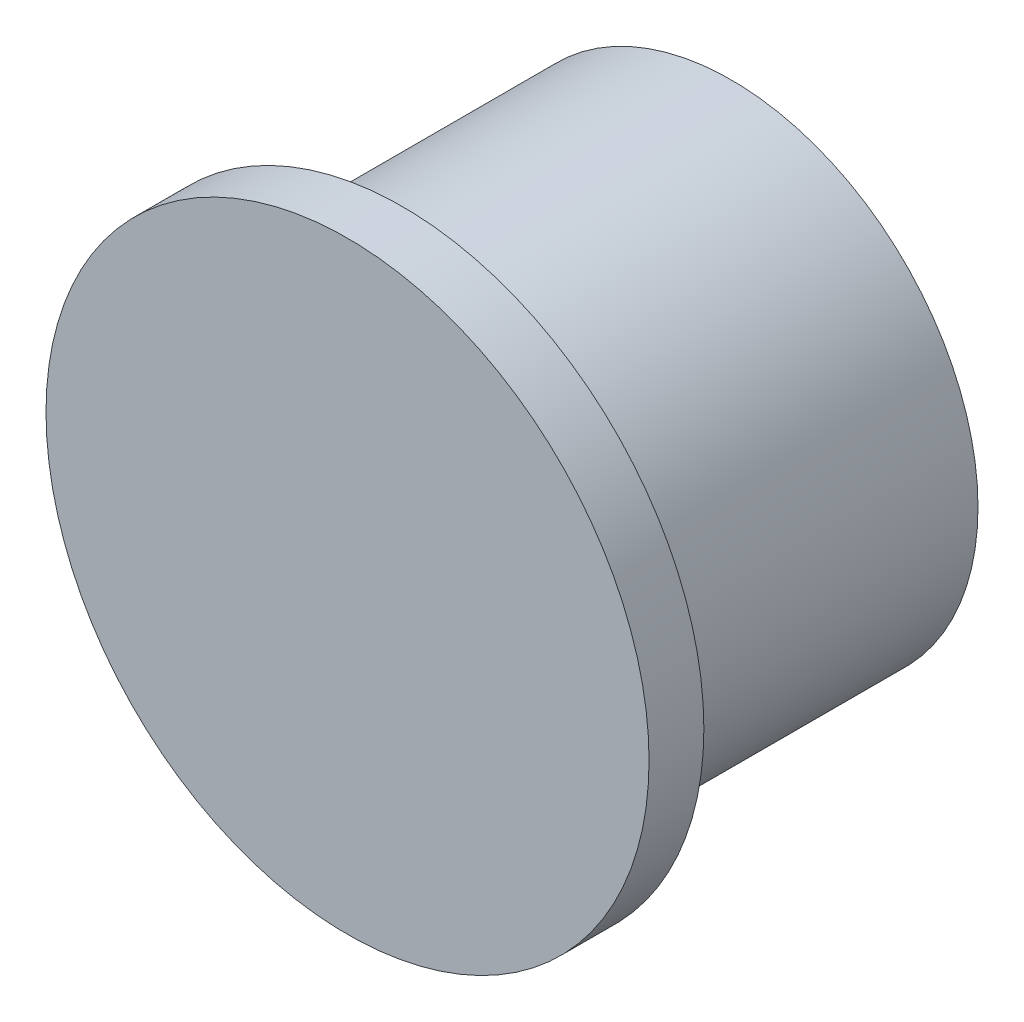
ISO-10303-21;
HEADER;
FILE_DESCRIPTION(('STEP AP214'),'2;1');
FILE_NAME('part.step','',(''),(''),'','','');
FILE_SCHEMA(('AUTOMOTIVE_DESIGN { 1 0 10303 214 1 1 1 1 }'));
ENDSEC;
DATA;
#1=APPLICATION_CONTEXT('core data for automotive mechanical design processes');
#2=APPLICATION_PROTOCOL_DEFINITION('international standard','automotive_design',2000,#1);
#3=PRODUCT_CONTEXT('',#1,'mechanical');
#4=PRODUCT('Part','Part','',(#3));
#5=PRODUCT_RELATED_PRODUCT_CATEGORY('part','',(#4));
#6=PRODUCT_DEFINITION_FORMATION('','',#4);
#7=PRODUCT_DEFINITION_CONTEXT('part definition',#1,'design');
#8=PRODUCT_DEFINITION('design','',#6,#7);
#9=PRODUCT_DEFINITION_SHAPE('','',#8);
#10=(LENGTH_UNIT() NAMED_UNIT(*) SI_UNIT(.MILLI.,.METRE.));
#11=(NAMED_UNIT(*) PLANE_ANGLE_UNIT() SI_UNIT($,.RADIAN.));
#12=(NAMED_UNIT(*) SI_UNIT($,.STERADIAN.) SOLID_ANGLE_UNIT());
#13=UNCERTAINTY_MEASURE_WITH_UNIT(LENGTH_MEASURE(1.E-05),#10,'distance_accuracy_value','');
#14=(GEOMETRIC_REPRESENTATION_CONTEXT(3) GLOBAL_UNCERTAINTY_ASSIGNED_CONTEXT((#13)) GLOBAL_UNIT_ASSIGNED_CONTEXT((#10,
#11,#12)) REPRESENTATION_CONTEXT('',''));
#15=CARTESIAN_POINT('',(0.,0.,0.));
#16=DIRECTION('',(0.,0.,1.));
#17=DIRECTION('',(1.,0.,0.));
#18=AXIS2_PLACEMENT_3D('',#15,#16,#17);
#19=CARTESIAN_POINT('',(0.,0.,2.));
#20=DIRECTION('',(0.,0.,-1.));
#21=DIRECTION('',(-1.,0.,0.));
#22=AXIS2_PLACEMENT_3D('',#19,#20,#21);
#23=CYLINDRICAL_SURFACE('',#22,11.);
#24=CARTESIAN_POINT('',(0.,0.,2.));
#25=DIRECTION('',(0.,0.,1.));
#26=DIRECTION('',(1.,0.,0.));
#27=AXIS2_PLACEMENT_3D('',#24,#25,#26);
#28=CIRCLE('',#27,11.);
#29=CARTESIAN_POINT('',(11.,0.,2.));
#30=VERTEX_POINT('',#29);
#31=EDGE_CURVE('E37',#30,#30,#28,.T.);
#32=ORIENTED_EDGE('',*,*,#31,.F.);
#33=EDGE_LOOP('',(#32));
#34=FACE_BOUND('',#33,.T.);
#35=CARTESIAN_POINT('',(0.,0.,0.));
#36=DIRECTION('',(0.,0.,1.));
#37=DIRECTION('',(1.,0.,0.));
#38=AXIS2_PLACEMENT_3D('',#35,#36,#37);
#39=CIRCLE('',#38,11.);
#40=CARTESIAN_POINT('',(11.,0.,0.));
#41=VERTEX_POINT('',#40);
#42=EDGE_CURVE('E41',#41,#41,#39,.T.);
#43=ORIENTED_EDGE('',*,*,#42,.T.);
#44=EDGE_LOOP('',(#43));
#45=FACE_BOUND('',#44,.T.);
#46=ADVANCED_FACE('F31',(#34,#45),#23,.T.);
#47=CARTESIAN_POINT('',(0.,0.,2.));
#48=DIRECTION('',(0.,0.,1.));
#49=DIRECTION('',(1.,0.,0.));
#50=AXIS2_PLACEMENT_3D('',#47,#48,#49);
#51=PLANE('',#50);
#52=ORIENTED_EDGE('',*,*,#31,.T.);
#53=EDGE_LOOP('',(#52));
#54=FACE_BOUND('',#53,.T.);
#55=ADVANCED_FACE('F62',(#54),#51,.T.);
#56=CARTESIAN_POINT('',(0.,0.,0.));
#57=DIRECTION('',(0.,0.,1.));
#58=DIRECTION('',(1.,0.,0.));
#59=AXIS2_PLACEMENT_3D('',#56,#57,#58);
#60=PLANE('',#59);
#61=CARTESIAN_POINT('',(0.,0.,0.));
#62=DIRECTION('',(0.,0.,1.));
#63=DIRECTION('',(1.,0.,0.));
#64=AXIS2_PLACEMENT_3D('',#61,#62,#63);
#65=CIRCLE('',#64,9.);
#66=CARTESIAN_POINT('',(9.,0.,0.));
#67=VERTEX_POINT('',#66);
#68=EDGE_CURVE('E10',#67,#67,#65,.F.);
#69=ORIENTED_EDGE('',*,*,#68,.F.);
#70=EDGE_LOOP('',(#69));
#71=FACE_BOUND('',#70,.T.);
#72=ORIENTED_EDGE('',*,*,#42,.F.);
#73=EDGE_LOOP('',(#72));
#74=FACE_BOUND('',#73,.T.);
#75=ADVANCED_FACE('F55',(#71,#74),#60,.F.);
#76=CARTESIAN_POINT('',(0.,0.,-12.));
#77=DIRECTION('',(0.,0.,1.));
#78=DIRECTION('',(1.,0.,0.));
#79=AXIS2_PLACEMENT_3D('',#76,#77,#78);
#80=CYLINDRICAL_SURFACE('',#79,9.);
#81=CARTESIAN_POINT('',(0.,0.,-12.));
#82=DIRECTION('',(0.,0.,-1.));
#83=DIRECTION('',(-1.,0.,0.));
#84=AXIS2_PLACEMENT_3D('',#81,#82,#83);
#85=CIRCLE('',#84,9.);
#86=CARTESIAN_POINT('',(-9.,0.,-12.));
#87=VERTEX_POINT('',#86);
#88=EDGE_CURVE('E46',#87,#87,#85,.T.);
#89=ORIENTED_EDGE('',*,*,#88,.F.);
#90=EDGE_LOOP('',(#89));
#91=FACE_BOUND('',#90,.T.);
#92=ORIENTED_EDGE('',*,*,#68,.T.);
#93=EDGE_LOOP('',(#92));
#94=FACE_BOUND('',#93,.T.);
#95=ADVANCED_FACE('F53',(#91,#94),#80,.T.);
#96=CARTESIAN_POINT('',(0.,0.,-12.));
#97=DIRECTION('',(0.,0.,-1.));
#98=DIRECTION('',(-1.,0.,0.));
#99=AXIS2_PLACEMENT_3D('',#96,#97,#98);
#100=PLANE('',#99);
#101=ORIENTED_EDGE('',*,*,#88,.T.);
#102=EDGE_LOOP('',(#101));
#103=FACE_BOUND('',#102,.T.);
#104=ADVANCED_FACE('F51',(#103),#100,.T.);
#105=CLOSED_SHELL('',(#46,#55,#75,#95,#104));
#106=MANIFOLD_SOLID_BREP('B2',#105);
#107=ADVANCED_BREP_SHAPE_REPRESENTATION('',(#18,#106),#14);
#108=SHAPE_DEFINITION_REPRESENTATION(#9,#107);
ENDSEC;
END-ISO-10303-21;
